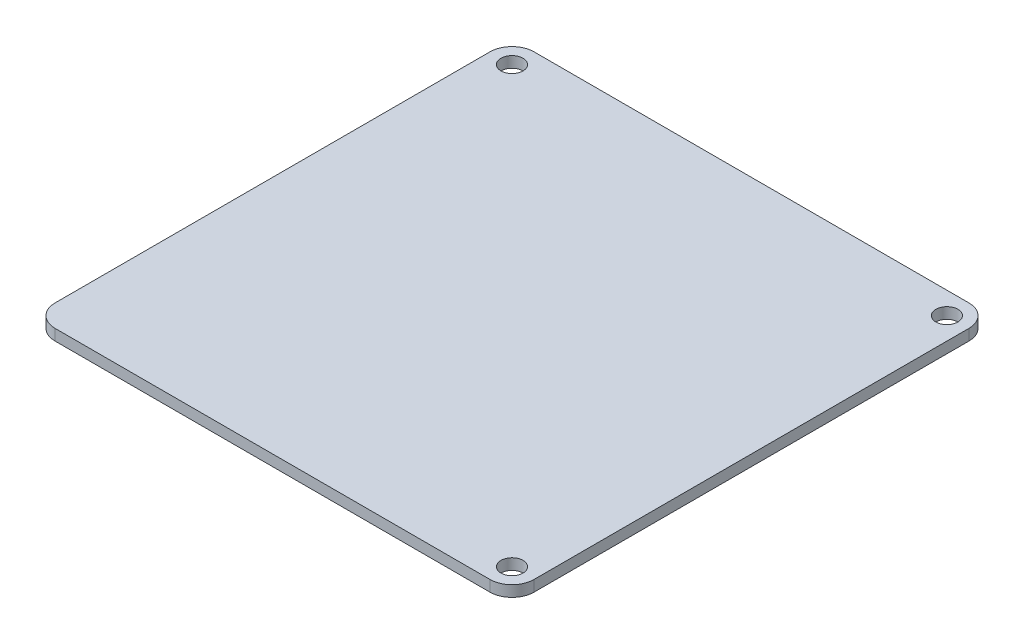
ISO-10303-21;
HEADER;
FILE_DESCRIPTION(('STEP AP214'),'2;1');
FILE_NAME('part.step','',(''),(''),'','','');
FILE_SCHEMA(('AUTOMOTIVE_DESIGN { 1 0 10303 214 1 1 1 1 }'));
ENDSEC;
DATA;
#1=APPLICATION_CONTEXT('core data for automotive mechanical design processes');
#2=APPLICATION_PROTOCOL_DEFINITION('international standard','automotive_design',2000,#1);
#3=PRODUCT_CONTEXT('',#1,'mechanical');
#4=PRODUCT('Part','Part','',(#3));
#5=PRODUCT_RELATED_PRODUCT_CATEGORY('part','',(#4));
#6=PRODUCT_DEFINITION_FORMATION('','',#4);
#7=PRODUCT_DEFINITION_CONTEXT('part definition',#1,'design');
#8=PRODUCT_DEFINITION('design','',#6,#7);
#9=PRODUCT_DEFINITION_SHAPE('','',#8);
#10=(LENGTH_UNIT() NAMED_UNIT(*) SI_UNIT(.MILLI.,.METRE.));
#11=(NAMED_UNIT(*) PLANE_ANGLE_UNIT() SI_UNIT($,.RADIAN.));
#12=(NAMED_UNIT(*) SI_UNIT($,.STERADIAN.) SOLID_ANGLE_UNIT());
#13=UNCERTAINTY_MEASURE_WITH_UNIT(LENGTH_MEASURE(1.E-05),#10,'distance_accuracy_value','');
#14=(GEOMETRIC_REPRESENTATION_CONTEXT(3) GLOBAL_UNCERTAINTY_ASSIGNED_CONTEXT((#13)) GLOBAL_UNIT_ASSIGNED_CONTEXT((#10,
#11,#12)) REPRESENTATION_CONTEXT('',''));
#15=CARTESIAN_POINT('',(0.,0.,0.));
#16=DIRECTION('',(0.,0.,1.));
#17=DIRECTION('',(1.,0.,0.));
#18=AXIS2_PLACEMENT_3D('',#15,#16,#17);
#19=CARTESIAN_POINT('',(0.,3.175,8.43460424202014));
#20=DIRECTION('',(0.,0.,-1.));
#21=DIRECTION('',(-1.,0.,0.));
#22=AXIS2_PLACEMENT_3D('',#19,#20,#21);
#23=PLANE('',#22);
#24=DIRECTION('',(1.,0.,0.));
#25=VECTOR('',#24,1.);
#26=CARTESIAN_POINT('',(0.,0.,8.43460424202014));
#27=LINE('',#26,#25);
#28=CARTESIAN_POINT('',(-0.99350661123257,0.,8.43460424202014));
#29=VERTEX_POINT('',#28);
#30=CARTESIAN_POINT('',(124.267660571417,0.,8.43460424202014));
#31=VERTEX_POINT('',#30);
#32=EDGE_CURVE('E142',#29,#31,#27,.T.);
#33=ORIENTED_EDGE('',*,*,#32,.T.);
#34=DIRECTION('',(0.,-1.,0.));
#35=VECTOR('',#34,1.);
#36=CARTESIAN_POINT('',(124.267660571417,3.175,8.43460424202014));
#37=LINE('',#36,#35);
#38=CARTESIAN_POINT('',(124.267660571417,3.175,8.43460424202014));
#39=VERTEX_POINT('',#38);
#40=EDGE_CURVE('E11',#39,#31,#37,.T.);
#41=ORIENTED_EDGE('',*,*,#40,.F.);
#42=DIRECTION('',(1.,0.,0.));
#43=VECTOR('',#42,1.);
#44=CARTESIAN_POINT('',(0.,3.175,8.43460424202014));
#45=LINE('',#44,#43);
#46=CARTESIAN_POINT('',(-0.99350661123257,3.175,8.43460424202014));
#47=VERTEX_POINT('',#46);
#48=EDGE_CURVE('E188',#47,#39,#45,.T.);
#49=ORIENTED_EDGE('',*,*,#48,.F.);
#50=DIRECTION('',(0.,-1.,0.));
#51=VECTOR('',#50,1.);
#52=CARTESIAN_POINT('',(-0.99350661123257,3.175,8.43460424202014));
#53=LINE('',#52,#51);
#54=EDGE_CURVE('E129',#47,#29,#53,.T.);
#55=ORIENTED_EDGE('',*,*,#54,.T.);
#56=EDGE_LOOP('',(#33,#41,#49,#55));
#57=FACE_BOUND('',#56,.T.);
#58=ADVANCED_FACE('F36',(#57),#23,.F.);
#59=CARTESIAN_POINT('',(124.267660571417,3.175,2.08460424202014));
#60=DIRECTION('',(0.,-1.,0.));
#61=DIRECTION('',(0.,0.,-1.));
#62=AXIS2_PLACEMENT_3D('',#59,#60,#61);
#63=CYLINDRICAL_SURFACE('',#62,6.34999999999999);
#64=CARTESIAN_POINT('',(124.267660571417,0.,2.08460424202014));
#65=DIRECTION('',(0.,1.,0.));
#66=DIRECTION('',(0.,0.,1.));
#67=AXIS2_PLACEMENT_3D('',#64,#65,#66);
#68=CIRCLE('',#67,6.34999999999999);
#69=CARTESIAN_POINT('',(130.617660571417,0.,2.08460424202014));
#70=VERTEX_POINT('',#69);
#71=EDGE_CURVE('E145',#31,#70,#68,.T.);
#72=ORIENTED_EDGE('',*,*,#71,.T.);
#73=DIRECTION('',(0.,-1.,0.));
#74=VECTOR('',#73,1.);
#75=CARTESIAN_POINT('',(130.617660571417,3.175,2.08460424202014));
#76=LINE('',#75,#74);
#77=CARTESIAN_POINT('',(130.617660571417,3.175,2.08460424202014));
#78=VERTEX_POINT('',#77);
#79=EDGE_CURVE('E45',#78,#70,#76,.T.);
#80=ORIENTED_EDGE('',*,*,#79,.F.);
#81=CARTESIAN_POINT('',(124.267660571417,3.175,2.08460424202014));
#82=DIRECTION('',(0.,1.,0.));
#83=DIRECTION('',(0.,0.,1.));
#84=AXIS2_PLACEMENT_3D('',#81,#82,#83);
#85=CIRCLE('',#84,6.34999999999999);
#86=EDGE_CURVE('E96',#39,#78,#85,.T.);
#87=ORIENTED_EDGE('',*,*,#86,.F.);
#88=ORIENTED_EDGE('',*,*,#40,.T.);
#89=EDGE_LOOP('',(#72,#80,#87,#88));
#90=FACE_BOUND('',#89,.T.);
#91=ADVANCED_FACE('F224',(#90),#63,.T.);
#92=CARTESIAN_POINT('',(130.617660571417,3.175,0.));
#93=DIRECTION('',(-1.,0.,0.));
#94=DIRECTION('',(0.,0.,1.));
#95=AXIS2_PLACEMENT_3D('',#92,#93,#94);
#96=PLANE('',#95);
#97=DIRECTION('',(0.,0.,-1.));
#98=VECTOR('',#97,1.);
#99=CARTESIAN_POINT('',(130.617660571417,0.,0.));
#100=LINE('',#99,#98);
#101=CARTESIAN_POINT('',(130.617660571417,0.,-123.176562940629));
#102=VERTEX_POINT('',#101);
#103=EDGE_CURVE('E147',#70,#102,#100,.T.);
#104=ORIENTED_EDGE('',*,*,#103,.T.);
#105=DIRECTION('',(0.,-1.,0.));
#106=VECTOR('',#105,1.);
#107=CARTESIAN_POINT('',(130.617660571417,3.175,-123.176562940629));
#108=LINE('',#107,#106);
#109=CARTESIAN_POINT('',(130.617660571417,3.175,-123.176562940629));
#110=VERTEX_POINT('',#109);
#111=EDGE_CURVE('E163',#110,#102,#108,.T.);
#112=ORIENTED_EDGE('',*,*,#111,.F.);
#113=DIRECTION('',(0.,0.,-1.));
#114=VECTOR('',#113,1.);
#115=CARTESIAN_POINT('',(130.617660571417,3.175,0.));
#116=LINE('',#115,#114);
#117=EDGE_CURVE('E171',#78,#110,#116,.T.);
#118=ORIENTED_EDGE('',*,*,#117,.F.);
#119=ORIENTED_EDGE('',*,*,#79,.T.);
#120=EDGE_LOOP('',(#104,#112,#118,#119));
#121=FACE_BOUND('',#120,.T.);
#122=ADVANCED_FACE('F169',(#121),#96,.F.);
#123=CARTESIAN_POINT('',(124.267660571417,3.175,-123.176562940629));
#124=DIRECTION('',(0.,-1.,0.));
#125=DIRECTION('',(0.,0.,-1.));
#126=AXIS2_PLACEMENT_3D('',#123,#124,#125);
#127=CYLINDRICAL_SURFACE('',#126,6.35000000000002);
#128=CARTESIAN_POINT('',(124.267660571417,0.,-123.176562940629));
#129=DIRECTION('',(0.,1.,0.));
#130=DIRECTION('',(0.,0.,1.));
#131=AXIS2_PLACEMENT_3D('',#128,#129,#130);
#132=CIRCLE('',#131,6.35000000000002);
#133=CARTESIAN_POINT('',(124.267660571417,0.,-129.526562940629));
#134=VERTEX_POINT('',#133);
#135=EDGE_CURVE('E149',#102,#134,#132,.T.);
#136=ORIENTED_EDGE('',*,*,#135,.T.);
#137=DIRECTION('',(0.,-1.,0.));
#138=VECTOR('',#137,1.);
#139=CARTESIAN_POINT('',(124.267660571417,3.175,-129.526562940629));
#140=LINE('',#139,#138);
#141=CARTESIAN_POINT('',(124.267660571417,3.175,-129.526562940629));
#142=VERTEX_POINT('',#141);
#143=EDGE_CURVE('E160',#142,#134,#140,.T.);
#144=ORIENTED_EDGE('',*,*,#143,.F.);
#145=CARTESIAN_POINT('',(124.267660571417,3.175,-123.176562940629));
#146=DIRECTION('',(0.,1.,0.));
#147=DIRECTION('',(0.,0.,1.));
#148=AXIS2_PLACEMENT_3D('',#145,#146,#147);
#149=CIRCLE('',#148,6.35000000000002);
#150=EDGE_CURVE('E183',#110,#142,#149,.T.);
#151=ORIENTED_EDGE('',*,*,#150,.F.);
#152=ORIENTED_EDGE('',*,*,#111,.T.);
#153=EDGE_LOOP('',(#136,#144,#151,#152));
#154=FACE_BOUND('',#153,.T.);
#155=ADVANCED_FACE('F179',(#154),#127,.T.);
#156=CARTESIAN_POINT('',(0.,3.175,-129.526562940629));
#157=DIRECTION('',(0.,0.,1.));
#158=DIRECTION('',(1.,0.,0.));
#159=AXIS2_PLACEMENT_3D('',#156,#157,#158);
#160=PLANE('',#159);
#161=DIRECTION('',(-1.,0.,0.));
#162=VECTOR('',#161,1.);
#163=CARTESIAN_POINT('',(0.,0.,-129.526562940629));
#164=LINE('',#163,#162);
#165=CARTESIAN_POINT('',(-0.993506611232597,0.,-129.526562940629));
#166=VERTEX_POINT('',#165);
#167=EDGE_CURVE('E151',#134,#166,#164,.T.);
#168=ORIENTED_EDGE('',*,*,#167,.T.);
#169=DIRECTION('',(0.,-1.,0.));
#170=VECTOR('',#169,1.);
#171=CARTESIAN_POINT('',(-0.993506611232597,3.175,-129.526562940629));
#172=LINE('',#171,#170);
#173=CARTESIAN_POINT('',(-0.993506611232597,3.175,-129.526562940629));
#174=VERTEX_POINT('',#173);
#175=EDGE_CURVE('E124',#174,#166,#172,.T.);
#176=ORIENTED_EDGE('',*,*,#175,.F.);
#177=DIRECTION('',(-1.,0.,0.));
#178=VECTOR('',#177,1.);
#179=CARTESIAN_POINT('',(0.,3.175,-129.526562940629));
#180=LINE('',#179,#178);
#181=EDGE_CURVE('E115',#142,#174,#180,.T.);
#182=ORIENTED_EDGE('',*,*,#181,.F.);
#183=ORIENTED_EDGE('',*,*,#143,.T.);
#184=EDGE_LOOP('',(#168,#176,#182,#183));
#185=FACE_BOUND('',#184,.T.);
#186=ADVANCED_FACE('F182',(#185),#160,.F.);
#187=CARTESIAN_POINT('',(-0.993506611232597,3.175,-123.176562940629));
#188=DIRECTION('',(0.,-1.,0.));
#189=DIRECTION('',(0.,0.,-1.));
#190=AXIS2_PLACEMENT_3D('',#187,#188,#189);
#191=CYLINDRICAL_SURFACE('',#190,6.35000000000001);
#192=CARTESIAN_POINT('',(-0.993506611232597,0.,-123.176562940629));
#193=DIRECTION('',(0.,1.,0.));
#194=DIRECTION('',(0.,0.,1.));
#195=AXIS2_PLACEMENT_3D('',#192,#193,#194);
#196=CIRCLE('',#195,6.35000000000001);
#197=CARTESIAN_POINT('',(-7.34350661123259,0.,-123.176562940629));
#198=VERTEX_POINT('',#197);
#199=EDGE_CURVE('E123',#166,#198,#196,.T.);
#200=ORIENTED_EDGE('',*,*,#199,.T.);
#201=DIRECTION('',(0.,-1.,0.));
#202=VECTOR('',#201,1.);
#203=CARTESIAN_POINT('',(-7.34350661123259,3.175,-123.176562940629));
#204=LINE('',#203,#202);
#205=CARTESIAN_POINT('',(-7.34350661123259,3.175,-123.176562940629));
#206=VERTEX_POINT('',#205);
#207=EDGE_CURVE('E120',#206,#198,#204,.T.);
#208=ORIENTED_EDGE('',*,*,#207,.F.);
#209=CARTESIAN_POINT('',(-0.993506611232597,3.175,-123.176562940629));
#210=DIRECTION('',(0.,1.,0.));
#211=DIRECTION('',(0.,0.,1.));
#212=AXIS2_PLACEMENT_3D('',#209,#210,#211);
#213=CIRCLE('',#212,6.35000000000001);
#214=EDGE_CURVE('E109',#174,#206,#213,.T.);
#215=ORIENTED_EDGE('',*,*,#214,.F.);
#216=ORIENTED_EDGE('',*,*,#175,.T.);
#217=EDGE_LOOP('',(#200,#208,#215,#216));
#218=FACE_BOUND('',#217,.T.);
#219=ADVANCED_FACE('F121',(#218),#191,.T.);
#220=CARTESIAN_POINT('',(-7.34350661123259,3.175,0.));
#221=DIRECTION('',(1.,0.,0.));
#222=DIRECTION('',(0.,0.,-1.));
#223=AXIS2_PLACEMENT_3D('',#220,#221,#222);
#224=PLANE('',#223);
#225=DIRECTION('',(0.,0.,1.));
#226=VECTOR('',#225,1.);
#227=CARTESIAN_POINT('',(-7.34350661123259,0.,0.));
#228=LINE('',#227,#226);
#229=CARTESIAN_POINT('',(-7.34350661123259,0.,2.08460424202014));
#230=VERTEX_POINT('',#229);
#231=EDGE_CURVE('E82',#198,#230,#228,.T.);
#232=ORIENTED_EDGE('',*,*,#231,.T.);
#233=DIRECTION('',(0.,-1.,0.));
#234=VECTOR('',#233,1.);
#235=CARTESIAN_POINT('',(-7.34350661123259,3.175,2.08460424202014));
#236=LINE('',#235,#234);
#237=CARTESIAN_POINT('',(-7.34350661123259,3.175,2.08460424202014));
#238=VERTEX_POINT('',#237);
#239=EDGE_CURVE('E125',#238,#230,#236,.T.);
#240=ORIENTED_EDGE('',*,*,#239,.F.);
#241=DIRECTION('',(0.,0.,1.));
#242=VECTOR('',#241,1.);
#243=CARTESIAN_POINT('',(-7.34350661123259,3.175,0.));
#244=LINE('',#243,#242);
#245=EDGE_CURVE('E113',#206,#238,#244,.T.);
#246=ORIENTED_EDGE('',*,*,#245,.F.);
#247=ORIENTED_EDGE('',*,*,#207,.T.);
#248=EDGE_LOOP('',(#232,#240,#246,#247));
#249=FACE_BOUND('',#248,.T.);
#250=ADVANCED_FACE('F127',(#249),#224,.F.);
#251=CARTESIAN_POINT('',(-0.993506611232847,3.175,-123.17656294063));
#252=DIRECTION('',(0.,-1.,0.));
#253=DIRECTION('',(0.,0.,-1.));
#254=AXIS2_PLACEMENT_3D('',#251,#252,#253);
#255=CYLINDRICAL_SURFACE('',#254,3.17499999999997);
#256=CARTESIAN_POINT('',(-0.993506611232847,3.175,-123.17656294063));
#257=DIRECTION('',(0.,1.,0.));
#258=DIRECTION('',(0.,0.,1.));
#259=AXIS2_PLACEMENT_3D('',#256,#257,#258);
#260=CIRCLE('',#259,3.17499999999997);
#261=CARTESIAN_POINT('',(-0.993506611232847,3.175,-120.00156294063));
#262=VERTEX_POINT('',#261);
#263=EDGE_CURVE('E190',#262,#262,#260,.T.);
#264=ORIENTED_EDGE('',*,*,#263,.T.);
#265=EDGE_LOOP('',(#264));
#266=FACE_BOUND('',#265,.T.);
#267=CARTESIAN_POINT('',(-0.993506611232847,0.,-123.17656294063));
#268=DIRECTION('',(0.,1.,0.));
#269=DIRECTION('',(0.,0.,1.));
#270=AXIS2_PLACEMENT_3D('',#267,#268,#269);
#271=CIRCLE('',#270,3.17499999999997);
#272=CARTESIAN_POINT('',(-0.993506611232847,0.,-120.00156294063));
#273=VERTEX_POINT('',#272);
#274=EDGE_CURVE('E139',#273,#273,#271,.T.);
#275=ORIENTED_EDGE('',*,*,#274,.F.);
#276=EDGE_LOOP('',(#275));
#277=FACE_BOUND('',#276,.T.);
#278=ADVANCED_FACE('F209',(#266,#277),#255,.F.);
#279=CARTESIAN_POINT('',(124.267660571417,3.175,-123.17656294063));
#280=DIRECTION('',(0.,-1.,0.));
#281=DIRECTION('',(0.,0.,-1.));
#282=AXIS2_PLACEMENT_3D('',#279,#280,#281);
#283=CYLINDRICAL_SURFACE('',#282,3.17499999999998);
#284=CARTESIAN_POINT('',(124.267660571417,3.175,-123.17656294063));
#285=DIRECTION('',(0.,1.,0.));
#286=DIRECTION('',(0.,0.,1.));
#287=AXIS2_PLACEMENT_3D('',#284,#285,#286);
#288=CIRCLE('',#287,3.17499999999998);
#289=CARTESIAN_POINT('',(124.267660571417,3.175,-120.00156294063));
#290=VERTEX_POINT('',#289);
#291=EDGE_CURVE('E193',#290,#290,#288,.T.);
#292=ORIENTED_EDGE('',*,*,#291,.T.);
#293=EDGE_LOOP('',(#292));
#294=FACE_BOUND('',#293,.T.);
#295=CARTESIAN_POINT('',(124.267660571417,0.,-123.17656294063));
#296=DIRECTION('',(0.,1.,0.));
#297=DIRECTION('',(0.,0.,1.));
#298=AXIS2_PLACEMENT_3D('',#295,#296,#297);
#299=CIRCLE('',#298,3.17499999999998);
#300=CARTESIAN_POINT('',(124.267660571417,0.,-120.00156294063));
#301=VERTEX_POINT('',#300);
#302=EDGE_CURVE('E136',#301,#301,#299,.T.);
#303=ORIENTED_EDGE('',*,*,#302,.F.);
#304=EDGE_LOOP('',(#303));
#305=FACE_BOUND('',#304,.T.);
#306=ADVANCED_FACE('F212',(#294,#305),#283,.F.);
#307=CARTESIAN_POINT('',(124.267660571417,3.175,2.08460424202034));
#308=DIRECTION('',(0.,-1.,0.));
#309=DIRECTION('',(0.,0.,-1.));
#310=AXIS2_PLACEMENT_3D('',#307,#308,#309);
#311=CYLINDRICAL_SURFACE('',#310,3.17500000000001);
#312=CARTESIAN_POINT('',(124.267660571417,3.175,2.08460424202034));
#313=DIRECTION('',(0.,1.,0.));
#314=DIRECTION('',(0.,0.,1.));
#315=AXIS2_PLACEMENT_3D('',#312,#313,#314);
#316=CIRCLE('',#315,3.17500000000001);
#317=CARTESIAN_POINT('',(124.267660571417,3.175,5.25960424202035));
#318=VERTEX_POINT('',#317);
#319=EDGE_CURVE('E156',#318,#318,#316,.T.);
#320=ORIENTED_EDGE('',*,*,#319,.T.);
#321=EDGE_LOOP('',(#320));
#322=FACE_BOUND('',#321,.T.);
#323=CARTESIAN_POINT('',(124.267660571417,0.,2.08460424202034));
#324=DIRECTION('',(0.,1.,0.));
#325=DIRECTION('',(0.,0.,1.));
#326=AXIS2_PLACEMENT_3D('',#323,#324,#325);
#327=CIRCLE('',#326,3.17500000000001);
#328=CARTESIAN_POINT('',(124.267660571417,0.,5.25960424202035));
#329=VERTEX_POINT('',#328);
#330=EDGE_CURVE('E133',#329,#329,#327,.T.);
#331=ORIENTED_EDGE('',*,*,#330,.F.);
#332=EDGE_LOOP('',(#331));
#333=FACE_BOUND('',#332,.T.);
#334=ADVANCED_FACE('F38',(#322,#333),#311,.F.);
#335=CARTESIAN_POINT('',(-0.99350661123257,3.175,2.08460424202014));
#336=DIRECTION('',(0.,-1.,0.));
#337=DIRECTION('',(0.,0.,-1.));
#338=AXIS2_PLACEMENT_3D('',#335,#336,#337);
#339=CYLINDRICAL_SURFACE('',#338,6.35000000000001);
#340=CARTESIAN_POINT('',(-0.99350661123257,0.,2.08460424202014));
#341=DIRECTION('',(0.,1.,0.));
#342=DIRECTION('',(0.,0.,1.));
#343=AXIS2_PLACEMENT_3D('',#340,#341,#342);
#344=CIRCLE('',#343,6.35000000000001);
#345=EDGE_CURVE('E88',#230,#29,#344,.T.);
#346=ORIENTED_EDGE('',*,*,#345,.T.);
#347=ORIENTED_EDGE('',*,*,#54,.F.);
#348=CARTESIAN_POINT('',(-0.99350661123257,3.175,2.08460424202014));
#349=DIRECTION('',(0.,1.,0.));
#350=DIRECTION('',(0.,0.,1.));
#351=AXIS2_PLACEMENT_3D('',#348,#349,#350);
#352=CIRCLE('',#351,6.35000000000001);
#353=EDGE_CURVE('E53',#238,#47,#352,.T.);
#354=ORIENTED_EDGE('',*,*,#353,.F.);
#355=ORIENTED_EDGE('',*,*,#239,.T.);
#356=EDGE_LOOP('',(#346,#347,#354,#355));
#357=FACE_BOUND('',#356,.T.);
#358=ADVANCED_FACE('F203',(#357),#339,.T.);
#359=CARTESIAN_POINT('',(0.,3.175,0.));
#360=DIRECTION('',(0.,1.,0.));
#361=DIRECTION('',(0.,0.,1.));
#362=AXIS2_PLACEMENT_3D('',#359,#360,#361);
#363=PLANE('',#362);
#364=ORIENTED_EDGE('',*,*,#319,.F.);
#365=EDGE_LOOP('',(#364));
#366=FACE_BOUND('',#365,.T.);
#367=ORIENTED_EDGE('',*,*,#291,.F.);
#368=EDGE_LOOP('',(#367));
#369=FACE_BOUND('',#368,.T.);
#370=ORIENTED_EDGE('',*,*,#263,.F.);
#371=EDGE_LOOP('',(#370));
#372=FACE_BOUND('',#371,.T.);
#373=ORIENTED_EDGE('',*,*,#48,.T.);
#374=ORIENTED_EDGE('',*,*,#86,.T.);
#375=ORIENTED_EDGE('',*,*,#117,.T.);
#376=ORIENTED_EDGE('',*,*,#150,.T.);
#377=ORIENTED_EDGE('',*,*,#181,.T.);
#378=ORIENTED_EDGE('',*,*,#214,.T.);
#379=ORIENTED_EDGE('',*,*,#245,.T.);
#380=ORIENTED_EDGE('',*,*,#353,.T.);
#381=EDGE_LOOP('',(#373,#374,#375,#376,#377,#378,#379,#380));
#382=FACE_BOUND('',#381,.T.);
#383=ADVANCED_FACE('F111',(#366,#369,#372,#382),#363,.T.);
#384=CARTESIAN_POINT('',(0.,0.,0.));
#385=DIRECTION('',(0.,1.,0.));
#386=DIRECTION('',(0.,0.,1.));
#387=AXIS2_PLACEMENT_3D('',#384,#385,#386);
#388=PLANE('',#387);
#389=ORIENTED_EDGE('',*,*,#330,.T.);
#390=EDGE_LOOP('',(#389));
#391=FACE_BOUND('',#390,.T.);
#392=ORIENTED_EDGE('',*,*,#302,.T.);
#393=EDGE_LOOP('',(#392));
#394=FACE_BOUND('',#393,.T.);
#395=ORIENTED_EDGE('',*,*,#274,.T.);
#396=EDGE_LOOP('',(#395));
#397=FACE_BOUND('',#396,.T.);
#398=ORIENTED_EDGE('',*,*,#32,.F.);
#399=ORIENTED_EDGE('',*,*,#345,.F.);
#400=ORIENTED_EDGE('',*,*,#231,.F.);
#401=ORIENTED_EDGE('',*,*,#199,.F.);
#402=ORIENTED_EDGE('',*,*,#167,.F.);
#403=ORIENTED_EDGE('',*,*,#135,.F.);
#404=ORIENTED_EDGE('',*,*,#103,.F.);
#405=ORIENTED_EDGE('',*,*,#71,.F.);
#406=EDGE_LOOP('',(#398,#399,#400,#401,#402,#403,#404,#405));
#407=FACE_BOUND('',#406,.T.);
#408=ADVANCED_FACE('F175',(#391,#394,#397,#407),#388,.F.);
#409=CLOSED_SHELL('',(#58,#91,#122,#155,#186,#219,#250,#278,#306,#334,#358,#383,#408));
#410=MANIFOLD_SOLID_BREP('B2',#409);
#411=ADVANCED_BREP_SHAPE_REPRESENTATION('',(#18,#410),#14);
#412=SHAPE_DEFINITION_REPRESENTATION(#9,#411);
ENDSEC;
END-ISO-10303-21;
